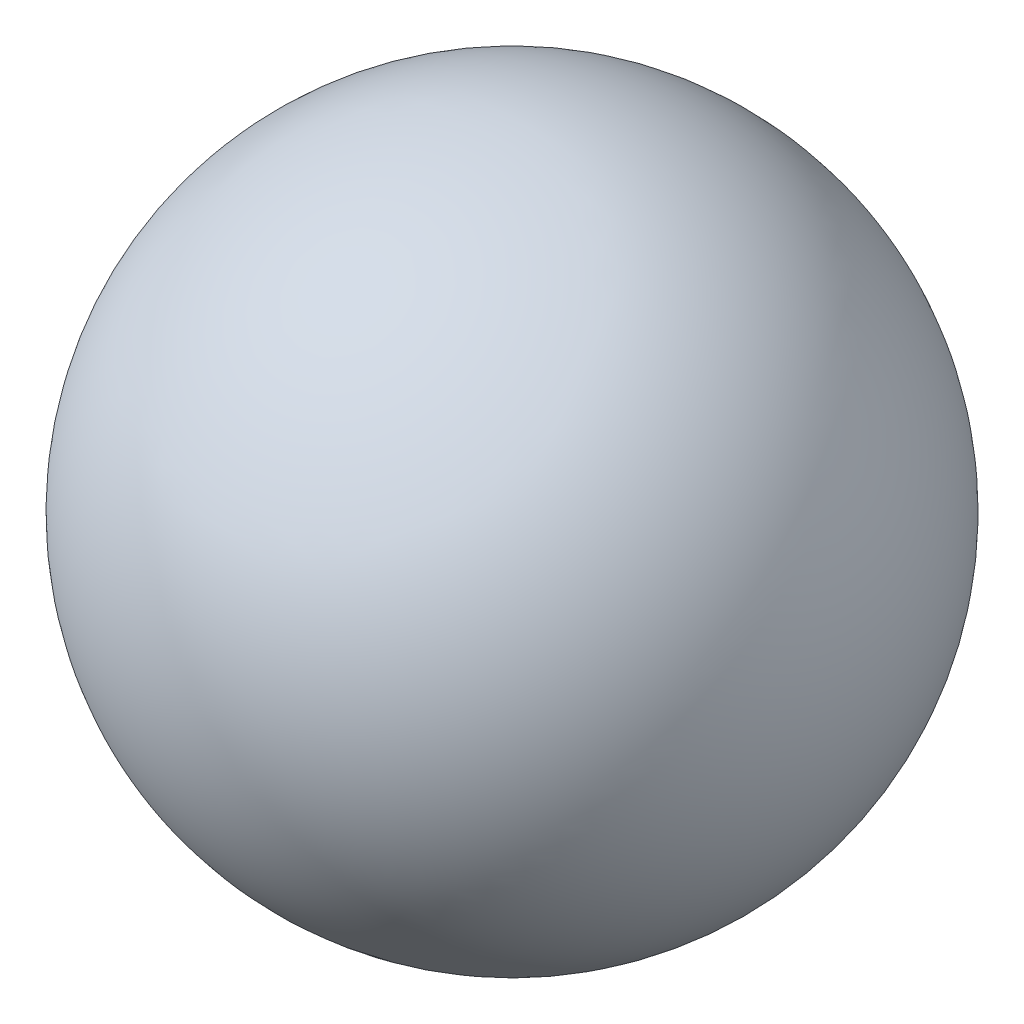
ISO-10303-21;
HEADER;
FILE_DESCRIPTION(('STEP AP214'),'2;1');
FILE_NAME('part.step','',(''),(''),'','','');
FILE_SCHEMA(('AUTOMOTIVE_DESIGN { 1 0 10303 214 1 1 1 1 }'));
ENDSEC;
DATA;
#1=APPLICATION_CONTEXT('core data for automotive mechanical design processes');
#2=APPLICATION_PROTOCOL_DEFINITION('international standard','automotive_design',2000,#1);
#3=PRODUCT_CONTEXT('',#1,'mechanical');
#4=PRODUCT('Part','Part','',(#3));
#5=PRODUCT_RELATED_PRODUCT_CATEGORY('part','',(#4));
#6=PRODUCT_DEFINITION_FORMATION('','',#4);
#7=PRODUCT_DEFINITION_CONTEXT('part definition',#1,'design');
#8=PRODUCT_DEFINITION('design','',#6,#7);
#9=PRODUCT_DEFINITION_SHAPE('','',#8);
#10=(LENGTH_UNIT() NAMED_UNIT(*) SI_UNIT(.MILLI.,.METRE.));
#11=(NAMED_UNIT(*) PLANE_ANGLE_UNIT() SI_UNIT($,.RADIAN.));
#12=(NAMED_UNIT(*) SI_UNIT($,.STERADIAN.) SOLID_ANGLE_UNIT());
#13=UNCERTAINTY_MEASURE_WITH_UNIT(LENGTH_MEASURE(1.E-05),#10,'distance_accuracy_value','');
#14=(GEOMETRIC_REPRESENTATION_CONTEXT(3) GLOBAL_UNCERTAINTY_ASSIGNED_CONTEXT((#13)) GLOBAL_UNIT_ASSIGNED_CONTEXT((#10,
#11,#12)) REPRESENTATION_CONTEXT('',''));
#15=CARTESIAN_POINT('',(0.,0.,0.));
#16=DIRECTION('',(0.,0.,1.));
#17=DIRECTION('',(1.,0.,0.));
#18=AXIS2_PLACEMENT_3D('',#15,#16,#17);
#19=CARTESIAN_POINT('',(67.76,-10.0419840403947,68.6165746214605));
#20=DIRECTION('',(0.,-0.144806720363312,0.989459960654104));
#21=DIRECTION('',(0.173648177666934,-0.974427840547316,-0.14260678090206));
#22=AXIS2_PLACEMENT_3D('',#19,#20,#21);
#23=SPHERICAL_SURFACE('',#22,7.15);
#24=CARTESIAN_POINT('',(67.76,-9.00661598979702,61.5419359027837));
#25=VERTEX_POINT('',#24);
#26=VERTEX_LOOP('',#25);
#27=FACE_BOUND('',#26,.T.);
#28=CARTESIAN_POINT('',(67.76,-11.0773520909924,75.6912133401373));
#29=VERTEX_POINT('',#28);
#30=VERTEX_LOOP('',#29);
#31=FACE_BOUND('',#30,.T.);
#32=ADVANCED_FACE('F16',(#27,#31),#23,.T.);
#33=CLOSED_SHELL('',(#32));
#34=MANIFOLD_SOLID_BREP('B1',#33);
#35=ADVANCED_BREP_SHAPE_REPRESENTATION('',(#18,#34),#14);
#36=SHAPE_DEFINITION_REPRESENTATION(#9,#35);
ENDSEC;
END-ISO-10303-21;
